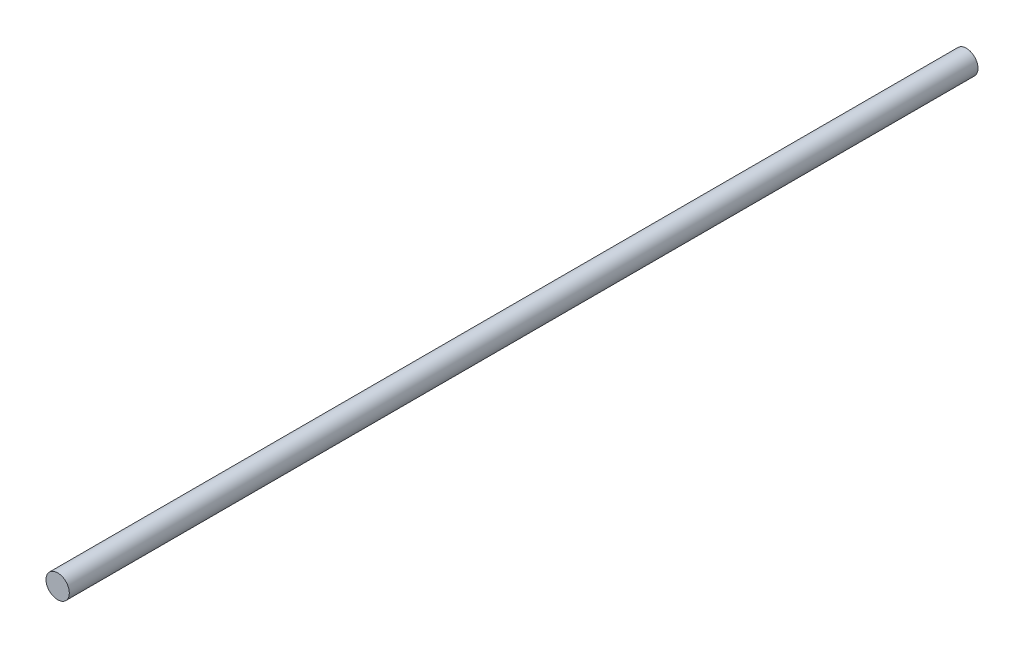
ISO-10303-21;
HEADER;
FILE_DESCRIPTION(('STEP AP214'),'2;1');
FILE_NAME('part.step','',(''),(''),'','','');
FILE_SCHEMA(('AUTOMOTIVE_DESIGN { 1 0 10303 214 1 1 1 1 }'));
ENDSEC;
DATA;
#1=APPLICATION_CONTEXT('core data for automotive mechanical design processes');
#2=APPLICATION_PROTOCOL_DEFINITION('international standard','automotive_design',2000,#1);
#3=PRODUCT_CONTEXT('',#1,'mechanical');
#4=PRODUCT('Part','Part','',(#3));
#5=PRODUCT_RELATED_PRODUCT_CATEGORY('part','',(#4));
#6=PRODUCT_DEFINITION_FORMATION('','',#4);
#7=PRODUCT_DEFINITION_CONTEXT('part definition',#1,'design');
#8=PRODUCT_DEFINITION('design','',#6,#7);
#9=PRODUCT_DEFINITION_SHAPE('','',#8);
#10=(LENGTH_UNIT() NAMED_UNIT(*) SI_UNIT(.MILLI.,.METRE.));
#11=(NAMED_UNIT(*) PLANE_ANGLE_UNIT() SI_UNIT($,.RADIAN.));
#12=(NAMED_UNIT(*) SI_UNIT($,.STERADIAN.) SOLID_ANGLE_UNIT());
#13=UNCERTAINTY_MEASURE_WITH_UNIT(LENGTH_MEASURE(1.E-05),#10,'distance_accuracy_value','');
#14=(GEOMETRIC_REPRESENTATION_CONTEXT(3) GLOBAL_UNCERTAINTY_ASSIGNED_CONTEXT((#13)) GLOBAL_UNIT_ASSIGNED_CONTEXT((#10,
#11,#12)) REPRESENTATION_CONTEXT('',''));
#15=CARTESIAN_POINT('',(0.,0.,0.));
#16=DIRECTION('',(0.,0.,1.));
#17=DIRECTION('',(1.,0.,0.));
#18=AXIS2_PLACEMENT_3D('',#15,#16,#17);
#19=CARTESIAN_POINT('',(0.,0.,311.5));
#20=DIRECTION('',(0.,0.,-1.));
#21=DIRECTION('',(-1.,0.,0.));
#22=AXIS2_PLACEMENT_3D('',#19,#20,#21);
#23=CYLINDRICAL_SURFACE('',#22,4.);
#24=CARTESIAN_POINT('',(0.,0.,311.5));
#25=DIRECTION('',(0.,0.,1.));
#26=DIRECTION('',(1.,0.,0.));
#27=AXIS2_PLACEMENT_3D('',#24,#25,#26);
#28=CIRCLE('',#27,4.);
#29=CARTESIAN_POINT('',(4.,0.,311.5));
#30=VERTEX_POINT('',#29);
#31=EDGE_CURVE('E10',#30,#30,#28,.T.);
#32=ORIENTED_EDGE('',*,*,#31,.F.);
#33=EDGE_LOOP('',(#32));
#34=FACE_BOUND('',#33,.T.);
#35=CARTESIAN_POINT('',(0.,0.,0.));
#36=DIRECTION('',(0.,0.,1.));
#37=DIRECTION('',(1.,0.,0.));
#38=AXIS2_PLACEMENT_3D('',#35,#36,#37);
#39=CIRCLE('',#38,4.);
#40=CARTESIAN_POINT('',(4.,0.,0.));
#41=VERTEX_POINT('',#40);
#42=EDGE_CURVE('E36',#41,#41,#39,.T.);
#43=ORIENTED_EDGE('',*,*,#42,.T.);
#44=EDGE_LOOP('',(#43));
#45=FACE_BOUND('',#44,.T.);
#46=ADVANCED_FACE('F33',(#34,#45),#23,.T.);
#47=CARTESIAN_POINT('',(0.,0.,311.5));
#48=DIRECTION('',(0.,0.,1.));
#49=DIRECTION('',(1.,0.,0.));
#50=AXIS2_PLACEMENT_3D('',#47,#48,#49);
#51=PLANE('',#50);
#52=ORIENTED_EDGE('',*,*,#31,.T.);
#53=EDGE_LOOP('',(#52));
#54=FACE_BOUND('',#53,.T.);
#55=ADVANCED_FACE('F48',(#54),#51,.T.);
#56=CARTESIAN_POINT('',(0.,0.,0.));
#57=DIRECTION('',(0.,0.,1.));
#58=DIRECTION('',(1.,0.,0.));
#59=AXIS2_PLACEMENT_3D('',#56,#57,#58);
#60=PLANE('',#59);
#61=ORIENTED_EDGE('',*,*,#42,.F.);
#62=EDGE_LOOP('',(#61));
#63=FACE_BOUND('',#62,.T.);
#64=ADVANCED_FACE('F46',(#63),#60,.F.);
#65=CLOSED_SHELL('',(#46,#55,#64));
#66=MANIFOLD_SOLID_BREP('B2',#65);
#67=ADVANCED_BREP_SHAPE_REPRESENTATION('',(#18,#66),#14);
#68=SHAPE_DEFINITION_REPRESENTATION(#9,#67);
ENDSEC;
END-ISO-10303-21;
